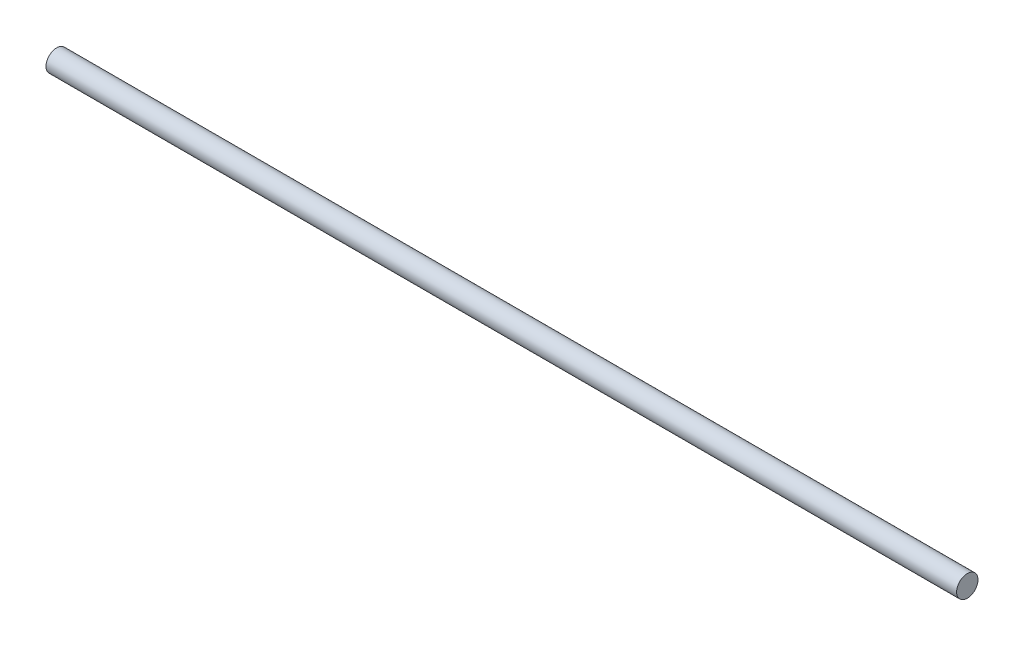
ISO-10303-21;
HEADER;
FILE_DESCRIPTION(('STEP AP214'),'2;1');
FILE_NAME('part.step','',(''),(''),'','','');
FILE_SCHEMA(('AUTOMOTIVE_DESIGN { 1 0 10303 214 1 1 1 1 }'));
ENDSEC;
DATA;
#1=APPLICATION_CONTEXT('core data for automotive mechanical design processes');
#2=APPLICATION_PROTOCOL_DEFINITION('international standard','automotive_design',2000,#1);
#3=PRODUCT_CONTEXT('',#1,'mechanical');
#4=PRODUCT('Part','Part','',(#3));
#5=PRODUCT_RELATED_PRODUCT_CATEGORY('part','',(#4));
#6=PRODUCT_DEFINITION_FORMATION('','',#4);
#7=PRODUCT_DEFINITION_CONTEXT('part definition',#1,'design');
#8=PRODUCT_DEFINITION('design','',#6,#7);
#9=PRODUCT_DEFINITION_SHAPE('','',#8);
#10=(LENGTH_UNIT() NAMED_UNIT(*) SI_UNIT(.MILLI.,.METRE.));
#11=(NAMED_UNIT(*) PLANE_ANGLE_UNIT() SI_UNIT($,.RADIAN.));
#12=(NAMED_UNIT(*) SI_UNIT($,.STERADIAN.) SOLID_ANGLE_UNIT());
#13=UNCERTAINTY_MEASURE_WITH_UNIT(LENGTH_MEASURE(1.E-05),#10,'distance_accuracy_value','');
#14=(GEOMETRIC_REPRESENTATION_CONTEXT(3) GLOBAL_UNCERTAINTY_ASSIGNED_CONTEXT((#13)) GLOBAL_UNIT_ASSIGNED_CONTEXT((#10,
#11,#12)) REPRESENTATION_CONTEXT('',''));
#15=CARTESIAN_POINT('',(0.,0.,0.));
#16=DIRECTION('',(0.,0.,1.));
#17=DIRECTION('',(1.,0.,0.));
#18=AXIS2_PLACEMENT_3D('',#15,#16,#17);
#19=CARTESIAN_POINT('',(0.,0.,0.));
#20=DIRECTION('',(1.,0.,0.));
#21=DIRECTION('',(0.,0.,-1.));
#22=AXIS2_PLACEMENT_3D('',#19,#20,#21);
#23=PLANE('',#22);
#24=CARTESIAN_POINT('',(0.,0.,0.));
#25=DIRECTION('',(1.,0.,0.));
#26=DIRECTION('',(0.,0.,-1.));
#27=AXIS2_PLACEMENT_3D('',#24,#25,#26);
#28=CIRCLE('',#27,6.35);
#29=CARTESIAN_POINT('',(0.,0.,-6.35));
#30=VERTEX_POINT('',#29);
#31=EDGE_CURVE('E18',#30,#30,#28,.T.);
#32=ORIENTED_EDGE('',*,*,#31,.F.);
#33=EDGE_LOOP('',(#32));
#34=FACE_BOUND('',#33,.T.);
#35=ADVANCED_FACE('F15',(#34),#23,.F.);
#36=CARTESIAN_POINT('',(539.75,0.,0.));
#37=DIRECTION('',(1.,0.,0.));
#38=DIRECTION('',(0.,0.,-1.));
#39=AXIS2_PLACEMENT_3D('',#36,#37,#38);
#40=PLANE('',#39);
#41=CARTESIAN_POINT('',(539.75,0.,0.));
#42=DIRECTION('',(1.,0.,0.));
#43=DIRECTION('',(0.,0.,-1.));
#44=AXIS2_PLACEMENT_3D('',#41,#42,#43);
#45=CIRCLE('',#44,6.35);
#46=CARTESIAN_POINT('',(539.75,0.,-6.35));
#47=VERTEX_POINT('',#46);
#48=EDGE_CURVE('E10',#47,#47,#45,.F.);
#49=ORIENTED_EDGE('',*,*,#48,.F.);
#50=EDGE_LOOP('',(#49));
#51=FACE_BOUND('',#50,.T.);
#52=ADVANCED_FACE('F30',(#51),#40,.T.);
#53=CARTESIAN_POINT('',(269.875,0.,0.));
#54=DIRECTION('',(1.,0.,0.));
#55=DIRECTION('',(0.,0.,-1.));
#56=AXIS2_PLACEMENT_3D('',#53,#54,#55);
#57=CYLINDRICAL_SURFACE('',#56,6.35);
#58=ORIENTED_EDGE('',*,*,#31,.T.);
#59=EDGE_LOOP('',(#58));
#60=FACE_BOUND('',#59,.T.);
#61=ORIENTED_EDGE('',*,*,#48,.T.);
#62=EDGE_LOOP('',(#61));
#63=FACE_BOUND('',#62,.T.);
#64=ADVANCED_FACE('F27',(#60,#63),#57,.T.);
#65=CLOSED_SHELL('',(#35,#52,#64));
#66=MANIFOLD_SOLID_BREP('B1',#65);
#67=ADVANCED_BREP_SHAPE_REPRESENTATION('',(#18,#66),#14);
#68=SHAPE_DEFINITION_REPRESENTATION(#9,#67);
ENDSEC;
END-ISO-10303-21;
